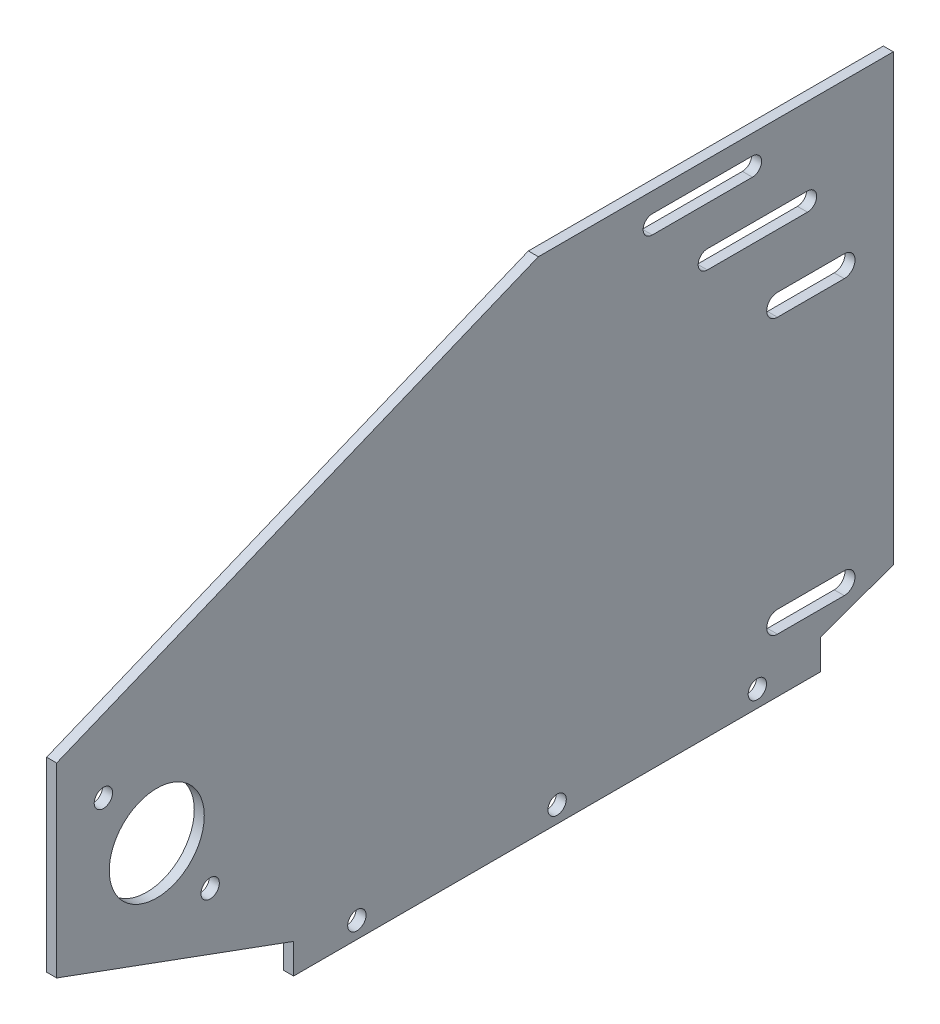
ISO-10303-21;
HEADER;
FILE_DESCRIPTION(('STEP AP214'),'2;1');
FILE_NAME('part.step','',(''),(''),'','','');
FILE_SCHEMA(('AUTOMOTIVE_DESIGN { 1 0 10303 214 1 1 1 1 }'));
ENDSEC;
DATA;
#1=APPLICATION_CONTEXT('core data for automotive mechanical design processes');
#2=APPLICATION_PROTOCOL_DEFINITION('international standard','automotive_design',2000,#1);
#3=PRODUCT_CONTEXT('',#1,'mechanical');
#4=PRODUCT('Part','Part','',(#3));
#5=PRODUCT_RELATED_PRODUCT_CATEGORY('part','',(#4));
#6=PRODUCT_DEFINITION_FORMATION('','',#4);
#7=PRODUCT_DEFINITION_CONTEXT('part definition',#1,'design');
#8=PRODUCT_DEFINITION('design','',#6,#7);
#9=PRODUCT_DEFINITION_SHAPE('','',#8);
#10=(LENGTH_UNIT() NAMED_UNIT(*) SI_UNIT(.MILLI.,.METRE.));
#11=(NAMED_UNIT(*) PLANE_ANGLE_UNIT() SI_UNIT($,.RADIAN.));
#12=(NAMED_UNIT(*) SI_UNIT($,.STERADIAN.) SOLID_ANGLE_UNIT());
#13=UNCERTAINTY_MEASURE_WITH_UNIT(LENGTH_MEASURE(1.E-05),#10,'distance_accuracy_value','');
#14=(GEOMETRIC_REPRESENTATION_CONTEXT(3) GLOBAL_UNCERTAINTY_ASSIGNED_CONTEXT((#13)) GLOBAL_UNIT_ASSIGNED_CONTEXT((#10,
#11,#12)) REPRESENTATION_CONTEXT('',''));
#15=CARTESIAN_POINT('',(0.,0.,0.));
#16=DIRECTION('',(0.,0.,1.));
#17=DIRECTION('',(1.,0.,0.));
#18=AXIS2_PLACEMENT_3D('',#15,#16,#17);
#19=CARTESIAN_POINT('',(3.,0.,0.));
#20=DIRECTION('',(-1.,0.,0.));
#21=DIRECTION('',(0.,0.,1.));
#22=AXIS2_PLACEMENT_3D('',#19,#20,#21);
#23=PLANE('',#22);
#24=DIRECTION('',(0.,0.,-1.));
#25=VECTOR('',#24,1.);
#26=CARTESIAN_POINT('',(3.,144.078111470038,0.));
#27=LINE('',#26,#25);
#28=CARTESIAN_POINT('',(3.,144.078111470038,-178.485850146743));
#29=VERTEX_POINT('',#28);
#30=CARTESIAN_POINT('',(3.,144.078111470038,-208.485850146743));
#31=VERTEX_POINT('',#30);
#32=EDGE_CURVE('E275',#29,#31,#27,.T.);
#33=ORIENTED_EDGE('',*,*,#32,.T.);
#34=CARTESIAN_POINT('',(3.,141.328111470038,-208.485850146743));
#35=DIRECTION('',(-1.,0.,0.));
#36=DIRECTION('',(0.,0.,1.));
#37=AXIS2_PLACEMENT_3D('',#34,#35,#36);
#38=CIRCLE('',#37,2.75000000000003);
#39=CARTESIAN_POINT('',(3.,138.578111470038,-208.485850146743));
#40=VERTEX_POINT('',#39);
#41=EDGE_CURVE('E273',#31,#40,#38,.T.);
#42=ORIENTED_EDGE('',*,*,#41,.T.);
#43=DIRECTION('',(0.,0.,1.));
#44=VECTOR('',#43,1.);
#45=CARTESIAN_POINT('',(3.,138.578111470038,0.));
#46=LINE('',#45,#44);
#47=CARTESIAN_POINT('',(3.,138.578111470038,-178.485850146743));
#48=VERTEX_POINT('',#47);
#49=EDGE_CURVE('E267',#40,#48,#46,.T.);
#50=ORIENTED_EDGE('',*,*,#49,.T.);
#51=CARTESIAN_POINT('',(3.,141.328111470038,-178.485850146743));
#52=DIRECTION('',(-1.,0.,0.));
#53=DIRECTION('',(0.,0.,1.));
#54=AXIS2_PLACEMENT_3D('',#51,#52,#53);
#55=CIRCLE('',#54,2.75000000000003);
#56=EDGE_CURVE('E211',#48,#29,#55,.T.);
#57=ORIENTED_EDGE('',*,*,#56,.T.);
#58=EDGE_LOOP('',(#33,#42,#50,#57));
#59=FACE_BOUND('',#58,.T.);
#60=DIRECTION('',(0.,0.,-1.));
#61=VECTOR('',#60,1.);
#62=CARTESIAN_POINT('',(3.,126.75,0.));
#63=LINE('',#62,#61);
#64=CARTESIAN_POINT('',(3.,126.75,-194.982842505866));
#65=VERTEX_POINT('',#64);
#66=CARTESIAN_POINT('',(3.,126.75,-224.982842505866));
#67=VERTEX_POINT('',#66);
#68=EDGE_CURVE('E265',#65,#67,#63,.T.);
#69=ORIENTED_EDGE('',*,*,#68,.T.);
#70=CARTESIAN_POINT('',(3.,124.,-224.982842505866));
#71=DIRECTION('',(-1.,0.,0.));
#72=DIRECTION('',(0.,0.,1.));
#73=AXIS2_PLACEMENT_3D('',#70,#71,#72);
#74=CIRCLE('',#73,2.75);
#75=CARTESIAN_POINT('',(3.,121.25,-224.982842505866));
#76=VERTEX_POINT('',#75);
#77=EDGE_CURVE('E268',#67,#76,#74,.T.);
#78=ORIENTED_EDGE('',*,*,#77,.T.);
#79=DIRECTION('',(0.,0.,1.));
#80=VECTOR('',#79,1.);
#81=CARTESIAN_POINT('',(3.,121.25,0.));
#82=LINE('',#81,#80);
#83=CARTESIAN_POINT('',(3.,121.25,-194.982842505866));
#84=VERTEX_POINT('',#83);
#85=EDGE_CURVE('E240',#76,#84,#82,.T.);
#86=ORIENTED_EDGE('',*,*,#85,.T.);
#87=CARTESIAN_POINT('',(3.,124.,-194.982842505866));
#88=DIRECTION('',(-1.,0.,0.));
#89=DIRECTION('',(0.,0.,1.));
#90=AXIS2_PLACEMENT_3D('',#87,#88,#89);
#91=CIRCLE('',#90,2.75);
#92=EDGE_CURVE('E257',#84,#65,#91,.T.);
#93=ORIENTED_EDGE('',*,*,#92,.T.);
#94=EDGE_LOOP('',(#69,#78,#86,#93));
#95=FACE_BOUND('',#94,.T.);
#96=CARTESIAN_POINT('',(3.,4.99999999999997,-209.962016184999));
#97=DIRECTION('',(-1.,0.,0.));
#98=DIRECTION('',(0.,0.,1.));
#99=AXIS2_PLACEMENT_3D('',#96,#97,#98);
#100=CIRCLE('',#99,2.75000000000001);
#101=CARTESIAN_POINT('',(3.,4.99999999999997,-207.212016184999));
#102=VERTEX_POINT('',#101);
#103=EDGE_CURVE('E279',#102,#102,#100,.T.);
#104=ORIENTED_EDGE('',*,*,#103,.T.);
#105=EDGE_LOOP('',(#104));
#106=FACE_BOUND('',#105,.T.);
#107=CARTESIAN_POINT('',(3.,4.99999999999997,-149.962016184999));
#108=DIRECTION('',(-1.,0.,0.));
#109=DIRECTION('',(0.,0.,1.));
#110=AXIS2_PLACEMENT_3D('',#107,#108,#109);
#111=CIRCLE('',#110,2.75000000000001);
#112=CARTESIAN_POINT('',(3.,4.99999999999997,-147.212016184999));
#113=VERTEX_POINT('',#112);
#114=EDGE_CURVE('E289',#113,#113,#111,.T.);
#115=ORIENTED_EDGE('',*,*,#114,.T.);
#116=EDGE_LOOP('',(#115));
#117=FACE_BOUND('',#116,.T.);
#118=CARTESIAN_POINT('',(3.,4.99999999999997,-89.9620161849988));
#119=DIRECTION('',(-1.,0.,0.));
#120=DIRECTION('',(0.,0.,1.));
#121=AXIS2_PLACEMENT_3D('',#118,#119,#120);
#122=CIRCLE('',#121,2.75000000000001);
#123=CARTESIAN_POINT('',(3.,4.99999999999997,-87.2120161849988));
#124=VERTEX_POINT('',#123);
#125=EDGE_CURVE('E276',#124,#124,#122,.T.);
#126=ORIENTED_EDGE('',*,*,#125,.T.);
#127=EDGE_LOOP('',(#126));
#128=FACE_BOUND('',#127,.T.);
#129=CARTESIAN_POINT('',(3.,55.,-30.));
#130=DIRECTION('',(1.,0.,0.));
#131=DIRECTION('',(0.,0.,-1.));
#132=AXIS2_PLACEMENT_3D('',#129,#130,#131);
#133=CIRCLE('',#132,14.235);
#134=CARTESIAN_POINT('',(3.,55.,-44.235));
#135=VERTEX_POINT('',#134);
#136=EDGE_CURVE('E426',#135,#135,#133,.T.);
#137=ORIENTED_EDGE('',*,*,#136,.F.);
#138=EDGE_LOOP('',(#137));
#139=FACE_BOUND('',#138,.T.);
#140=DIRECTION('',(0.,0.,-1.));
#141=VECTOR('',#140,1.);
#142=CARTESIAN_POINT('',(3.,98.4784135911546,-216.));
#143=LINE('',#142,#141);
#144=CARTESIAN_POINT('',(3.,98.4784135911546,-216.));
#145=VERTEX_POINT('',#144);
#146=CARTESIAN_POINT('',(3.,98.4784135911546,-236.));
#147=VERTEX_POINT('',#146);
#148=EDGE_CURVE('E392',#145,#147,#143,.T.);
#149=ORIENTED_EDGE('',*,*,#148,.F.);
#150=CARTESIAN_POINT('',(3.,101.708413591155,-216.));
#151=DIRECTION('',(-1.,0.,0.));
#152=DIRECTION('',(0.,0.,1.));
#153=AXIS2_PLACEMENT_3D('',#150,#151,#152);
#154=CIRCLE('',#153,3.22999999999997);
#155=CARTESIAN_POINT('',(3.,104.938413591155,-216.));
#156=VERTEX_POINT('',#155);
#157=EDGE_CURVE('E397',#156,#145,#154,.F.);
#158=ORIENTED_EDGE('',*,*,#157,.F.);
#159=DIRECTION('',(0.,0.,1.));
#160=VECTOR('',#159,1.);
#161=CARTESIAN_POINT('',(3.,104.938413591155,-216.));
#162=LINE('',#161,#160);
#163=CARTESIAN_POINT('',(3.,104.938413591155,-236.));
#164=VERTEX_POINT('',#163);
#165=EDGE_CURVE('E420',#164,#156,#162,.T.);
#166=ORIENTED_EDGE('',*,*,#165,.F.);
#167=CARTESIAN_POINT('',(3.,101.708413591155,-236.));
#168=DIRECTION('',(-1.,0.,0.));
#169=DIRECTION('',(0.,0.,1.));
#170=AXIS2_PLACEMENT_3D('',#167,#168,#169);
#171=CIRCLE('',#170,3.22999999999997);
#172=EDGE_CURVE('E391',#147,#164,#171,.F.);
#173=ORIENTED_EDGE('',*,*,#172,.F.);
#174=EDGE_LOOP('',(#149,#158,#166,#173));
#175=FACE_BOUND('',#174,.T.);
#176=DIRECTION('',(0.,0.,1.));
#177=VECTOR('',#176,1.);
#178=CARTESIAN_POINT('',(3.,22.6816943557675,-236.));
#179=LINE('',#178,#177);
#180=CARTESIAN_POINT('',(3.,22.6816943557675,-236.));
#181=VERTEX_POINT('',#180);
#182=CARTESIAN_POINT('',(3.,22.6816943557675,-216.));
#183=VERTEX_POINT('',#182);
#184=EDGE_CURVE('E383',#181,#183,#179,.T.);
#185=ORIENTED_EDGE('',*,*,#184,.F.);
#186=CARTESIAN_POINT('',(3.,19.4566943557675,-236.));
#187=DIRECTION('',(-1.,0.,0.));
#188=DIRECTION('',(0.,0.,1.));
#189=AXIS2_PLACEMENT_3D('',#186,#187,#188);
#190=CIRCLE('',#189,3.225);
#191=CARTESIAN_POINT('',(3.,16.2316943557675,-236.));
#192=VERTEX_POINT('',#191);
#193=EDGE_CURVE('E382',#192,#181,#190,.F.);
#194=ORIENTED_EDGE('',*,*,#193,.F.);
#195=DIRECTION('',(0.,0.,-1.));
#196=VECTOR('',#195,1.);
#197=CARTESIAN_POINT('',(3.,16.2316943557675,-236.));
#198=LINE('',#197,#196);
#199=CARTESIAN_POINT('',(3.,16.2316943557675,-216.));
#200=VERTEX_POINT('',#199);
#201=EDGE_CURVE('E346',#200,#192,#198,.T.);
#202=ORIENTED_EDGE('',*,*,#201,.F.);
#203=CARTESIAN_POINT('',(3.,19.4566943557675,-216.));
#204=DIRECTION('',(-1.,0.,0.));
#205=DIRECTION('',(0.,0.,1.));
#206=AXIS2_PLACEMENT_3D('',#203,#204,#205);
#207=CIRCLE('',#206,3.225);
#208=EDGE_CURVE('E389',#183,#200,#207,.F.);
#209=ORIENTED_EDGE('',*,*,#208,.F.);
#210=EDGE_LOOP('',(#185,#194,#202,#209));
#211=FACE_BOUND('',#210,.T.);
#212=CARTESIAN_POINT('',(3.,74.7317953801237,-14.0057431846019));
#213=DIRECTION('',(1.,0.,0.));
#214=DIRECTION('',(0.,0.,-1.));
#215=AXIS2_PLACEMENT_3D('',#212,#213,#214);
#216=CIRCLE('',#215,2.75);
#217=CARTESIAN_POINT('',(3.,74.7317953801237,-16.7557431846019));
#218=VERTEX_POINT('',#217);
#219=EDGE_CURVE('E355',#218,#218,#216,.T.);
#220=ORIENTED_EDGE('',*,*,#219,.F.);
#221=EDGE_LOOP('',(#220));
#222=FACE_BOUND('',#221,.T.);
#223=CARTESIAN_POINT('',(3.,35.2682046198761,-45.9942568153991));
#224=DIRECTION('',(1.,0.,0.));
#225=DIRECTION('',(0.,0.,-1.));
#226=AXIS2_PLACEMENT_3D('',#223,#224,#225);
#227=CIRCLE('',#226,2.75);
#228=CARTESIAN_POINT('',(3.,35.2682046198761,-48.7442568153991));
#229=VERTEX_POINT('',#228);
#230=EDGE_CURVE('E350',#229,#229,#227,.T.);
#231=ORIENTED_EDGE('',*,*,#230,.F.);
#232=EDGE_LOOP('',(#231));
#233=FACE_BOUND('',#232,.T.);
#234=DIRECTION('',(0.,0.379469489018988,-0.925204251451358));
#235=VECTOR('',#234,1.);
#236=CARTESIAN_POINT('',(3.,150.745674321996,-146.165756513085));
#237=LINE('',#236,#235);
#238=CARTESIAN_POINT('',(3.,90.796268718762,0.));
#239=VERTEX_POINT('',#238);
#240=CARTESIAN_POINT('',(3.,150.,-144.347689256367));
#241=VERTEX_POINT('',#240);
#242=EDGE_CURVE('E285',#239,#241,#237,.T.);
#243=ORIENTED_EDGE('',*,*,#242,.F.);
#244=DIRECTION('',(0.,-1.,0.));
#245=VECTOR('',#244,1.);
#246=CARTESIAN_POINT('',(3.,0.,0.));
#247=LINE('',#246,#245);
#248=CARTESIAN_POINT('',(3.,35.,0.));
#249=VERTEX_POINT('',#248);
#250=EDGE_CURVE('E434',#239,#249,#247,.T.);
#251=ORIENTED_EDGE('',*,*,#250,.T.);
#252=DIRECTION('',(0.,0.343866011956347,0.939018724957728));
#253=VECTOR('',#252,1.);
#254=CARTESIAN_POINT('',(3.,8.99999999999993,-71.000000000001));
#255=LINE('',#254,#253);
#256=CARTESIAN_POINT('',(3.,8.99999999999993,-71.000000000001));
#257=VERTEX_POINT('',#256);
#258=EDGE_CURVE('E328',#257,#249,#255,.T.);
#259=ORIENTED_EDGE('',*,*,#258,.F.);
#260=DIRECTION('',(0.,1.,-1.07938349616336E-13));
#261=VECTOR('',#260,1.);
#262=CARTESIAN_POINT('',(3.,0.,-71.));
#263=LINE('',#262,#261);
#264=CARTESIAN_POINT('',(3.,0.,-71.));
#265=VERTEX_POINT('',#264);
#266=EDGE_CURVE('E324',#265,#257,#263,.T.);
#267=ORIENTED_EDGE('',*,*,#266,.F.);
#268=DIRECTION('',(0.,0.,-1.));
#269=VECTOR('',#268,1.);
#270=CARTESIAN_POINT('',(3.,0.,0.));
#271=LINE('',#270,#269);
#272=CARTESIAN_POINT('',(3.,0.,-228.924032369997));
#273=VERTEX_POINT('',#272);
#274=EDGE_CURVE('E440',#265,#273,#271,.T.);
#275=ORIENTED_EDGE('',*,*,#274,.T.);
#276=DIRECTION('',(0.,-1.,1.07938349616336E-13));
#277=VECTOR('',#276,1.);
#278=CARTESIAN_POINT('',(3.,0.,-228.924032369998));
#279=LINE('',#278,#277);
#280=CARTESIAN_POINT('',(3.,8.99999999999988,-228.924032369999));
#281=VERTEX_POINT('',#280);
#282=EDGE_CURVE('E306',#281,#273,#279,.T.);
#283=ORIENTED_EDGE('',*,*,#282,.F.);
#284=DIRECTION('',(0.,-0.339870380460165,0.940472287994634));
#285=VECTOR('',#284,1.);
#286=CARTESIAN_POINT('',(3.,8.99999999999988,-228.924032369999));
#287=LINE('',#286,#285);
#288=CARTESIAN_POINT('',(3.,16.8759471545119,-250.717958720685));
#289=VERTEX_POINT('',#288);
#290=EDGE_CURVE('E311',#289,#281,#287,.T.);
#291=ORIENTED_EDGE('',*,*,#290,.F.);
#292=DIRECTION('',(0.,-1.,0.));
#293=VECTOR('',#292,1.);
#294=CARTESIAN_POINT('',(3.,16.8759471545119,-250.717958720685));
#295=LINE('',#294,#293);
#296=CARTESIAN_POINT('',(3.,150.,-250.717958720685));
#297=VERTEX_POINT('',#296);
#298=EDGE_CURVE('E308',#297,#289,#295,.T.);
#299=ORIENTED_EDGE('',*,*,#298,.F.);
#300=DIRECTION('',(0.,0.,1.));
#301=VECTOR('',#300,1.);
#302=CARTESIAN_POINT('',(3.,150.,0.));
#303=LINE('',#302,#301);
#304=EDGE_CURVE('E325',#297,#241,#303,.T.);
#305=ORIENTED_EDGE('',*,*,#304,.T.);
#306=EDGE_LOOP('',(#243,#251,#259,#267,#275,#283,#291,#299,#305));
#307=FACE_BOUND('',#306,.T.);
#308=ADVANCED_FACE('F41',(#59,#95,#106,#117,#128,#139,#175,#211,#222,#233,#307),#23,.F.);
#309=CARTESIAN_POINT('',(3.,150.,0.));
#310=DIRECTION('',(0.,-1.,0.));
#311=DIRECTION('',(0.,0.,-1.));
#312=AXIS2_PLACEMENT_3D('',#309,#310,#311);
#313=PLANE('',#312);
#314=DIRECTION('',(0.,0.,1.));
#315=VECTOR('',#314,1.);
#316=CARTESIAN_POINT('',(0.,150.,0.));
#317=LINE('',#316,#315);
#318=CARTESIAN_POINT('',(0.,150.,-250.717958720685));
#319=VERTEX_POINT('',#318);
#320=CARTESIAN_POINT('',(0.,150.,-144.347689256367));
#321=VERTEX_POINT('',#320);
#322=EDGE_CURVE('E438',#319,#321,#317,.T.);
#323=ORIENTED_EDGE('',*,*,#322,.T.);
#324=DIRECTION('',(1.,0.,0.));
#325=VECTOR('',#324,1.);
#326=CARTESIAN_POINT('',(3.,150.,-144.347689256367));
#327=LINE('',#326,#325);
#328=EDGE_CURVE('E303',#321,#241,#327,.T.);
#329=ORIENTED_EDGE('',*,*,#328,.T.);
#330=ORIENTED_EDGE('',*,*,#304,.F.);
#331=DIRECTION('',(1.,0.,0.));
#332=VECTOR('',#331,1.);
#333=CARTESIAN_POINT('',(-7.,150.,-250.717958720685));
#334=LINE('',#333,#332);
#335=EDGE_CURVE('E316',#319,#297,#334,.T.);
#336=ORIENTED_EDGE('',*,*,#335,.F.);
#337=EDGE_LOOP('',(#323,#329,#330,#336));
#338=FACE_BOUND('',#337,.T.);
#339=ADVANCED_FACE('F468',(#338),#313,.F.);
#340=CARTESIAN_POINT('',(0.,0.,0.));
#341=DIRECTION('',(-1.,0.,0.));
#342=DIRECTION('',(0.,0.,1.));
#343=AXIS2_PLACEMENT_3D('',#340,#341,#342);
#344=PLANE('',#343);
#345=CARTESIAN_POINT('',(0.,141.328111470038,-208.485850146743));
#346=DIRECTION('',(-1.,0.,0.));
#347=DIRECTION('',(0.,0.,1.));
#348=AXIS2_PLACEMENT_3D('',#345,#346,#347);
#349=CIRCLE('',#348,2.75000000000003);
#350=CARTESIAN_POINT('',(0.,144.078111470038,-208.485850146743));
#351=VERTEX_POINT('',#350);
#352=CARTESIAN_POINT('',(0.,138.578111470038,-208.485850146743));
#353=VERTEX_POINT('',#352);
#354=EDGE_CURVE('E224',#351,#353,#349,.T.);
#355=ORIENTED_EDGE('',*,*,#354,.F.);
#356=DIRECTION('',(0.,0.,-1.));
#357=VECTOR('',#356,1.);
#358=CARTESIAN_POINT('',(0.,144.078111470038,-208.485850146743));
#359=LINE('',#358,#357);
#360=CARTESIAN_POINT('',(0.,144.078111470038,-178.485850146743));
#361=VERTEX_POINT('',#360);
#362=EDGE_CURVE('E229',#361,#351,#359,.T.);
#363=ORIENTED_EDGE('',*,*,#362,.F.);
#364=CARTESIAN_POINT('',(0.,141.328111470038,-178.485850146743));
#365=DIRECTION('',(-1.,0.,0.));
#366=DIRECTION('',(0.,0.,1.));
#367=AXIS2_PLACEMENT_3D('',#364,#365,#366);
#368=CIRCLE('',#367,2.75000000000003);
#369=CARTESIAN_POINT('',(0.,138.578111470038,-178.485850146743));
#370=VERTEX_POINT('',#369);
#371=EDGE_CURVE('E208',#370,#361,#368,.T.);
#372=ORIENTED_EDGE('',*,*,#371,.F.);
#373=DIRECTION('',(0.,0.,1.));
#374=VECTOR('',#373,1.);
#375=CARTESIAN_POINT('',(0.,138.578111470038,-208.485850146743));
#376=LINE('',#375,#374);
#377=EDGE_CURVE('E217',#353,#370,#376,.T.);
#378=ORIENTED_EDGE('',*,*,#377,.F.);
#379=EDGE_LOOP('',(#355,#363,#372,#378));
#380=FACE_BOUND('',#379,.T.);
#381=CARTESIAN_POINT('',(0.,124.,-224.982842505866));
#382=DIRECTION('',(-1.,0.,0.));
#383=DIRECTION('',(0.,0.,1.));
#384=AXIS2_PLACEMENT_3D('',#381,#382,#383);
#385=CIRCLE('',#384,2.75);
#386=CARTESIAN_POINT('',(0.,126.75,-224.982842505866));
#387=VERTEX_POINT('',#386);
#388=CARTESIAN_POINT('',(0.,121.25,-224.982842505866));
#389=VERTEX_POINT('',#388);
#390=EDGE_CURVE('E258',#387,#389,#385,.T.);
#391=ORIENTED_EDGE('',*,*,#390,.F.);
#392=DIRECTION('',(0.,0.,-1.));
#393=VECTOR('',#392,1.);
#394=CARTESIAN_POINT('',(0.,126.75,-224.982842505866));
#395=LINE('',#394,#393);
#396=CARTESIAN_POINT('',(0.,126.75,-194.982842505866));
#397=VERTEX_POINT('',#396);
#398=EDGE_CURVE('E243',#397,#387,#395,.T.);
#399=ORIENTED_EDGE('',*,*,#398,.F.);
#400=CARTESIAN_POINT('',(0.,124.,-194.982842505866));
#401=DIRECTION('',(-1.,0.,0.));
#402=DIRECTION('',(0.,0.,1.));
#403=AXIS2_PLACEMENT_3D('',#400,#401,#402);
#404=CIRCLE('',#403,2.75);
#405=CARTESIAN_POINT('',(0.,121.25,-194.982842505866));
#406=VERTEX_POINT('',#405);
#407=EDGE_CURVE('E252',#406,#397,#404,.T.);
#408=ORIENTED_EDGE('',*,*,#407,.F.);
#409=DIRECTION('',(0.,0.,1.));
#410=VECTOR('',#409,1.);
#411=CARTESIAN_POINT('',(0.,121.25,-224.982842505866));
#412=LINE('',#411,#410);
#413=EDGE_CURVE('E251',#389,#406,#412,.T.);
#414=ORIENTED_EDGE('',*,*,#413,.F.);
#415=EDGE_LOOP('',(#391,#399,#408,#414));
#416=FACE_BOUND('',#415,.T.);
#417=CARTESIAN_POINT('',(0.,4.99999999999997,-209.962016184999));
#418=DIRECTION('',(-1.,0.,0.));
#419=DIRECTION('',(0.,0.,1.));
#420=AXIS2_PLACEMENT_3D('',#417,#418,#419);
#421=CIRCLE('',#420,2.75000000000001);
#422=CARTESIAN_POINT('',(0.,4.99999999999997,-207.212016184999));
#423=VERTEX_POINT('',#422);
#424=EDGE_CURVE('E283',#423,#423,#421,.T.);
#425=ORIENTED_EDGE('',*,*,#424,.F.);
#426=EDGE_LOOP('',(#425));
#427=FACE_BOUND('',#426,.T.);
#428=CARTESIAN_POINT('',(0.,4.99999999999997,-149.962016184999));
#429=DIRECTION('',(-1.,0.,0.));
#430=DIRECTION('',(0.,0.,1.));
#431=AXIS2_PLACEMENT_3D('',#428,#429,#430);
#432=CIRCLE('',#431,2.75000000000001);
#433=CARTESIAN_POINT('',(0.,4.99999999999997,-147.212016184999));
#434=VERTEX_POINT('',#433);
#435=EDGE_CURVE('E290',#434,#434,#432,.T.);
#436=ORIENTED_EDGE('',*,*,#435,.F.);
#437=EDGE_LOOP('',(#436));
#438=FACE_BOUND('',#437,.T.);
#439=CARTESIAN_POINT('',(0.,4.99999999999997,-89.9620161849988));
#440=DIRECTION('',(-1.,0.,0.));
#441=DIRECTION('',(0.,0.,1.));
#442=AXIS2_PLACEMENT_3D('',#439,#440,#441);
#443=CIRCLE('',#442,2.75000000000001);
#444=CARTESIAN_POINT('',(0.,4.99999999999997,-87.2120161849988));
#445=VERTEX_POINT('',#444);
#446=EDGE_CURVE('E295',#445,#445,#443,.T.);
#447=ORIENTED_EDGE('',*,*,#446,.F.);
#448=EDGE_LOOP('',(#447));
#449=FACE_BOUND('',#448,.T.);
#450=DIRECTION('',(0.,-0.379469489018988,0.925204251451358));
#451=VECTOR('',#450,1.);
#452=CARTESIAN_POINT('',(0.,77.7218699592669,31.8773700323769));
#453=LINE('',#452,#451);
#454=CARTESIAN_POINT('',(0.,90.796268718762,0.));
#455=VERTEX_POINT('',#454);
#456=EDGE_CURVE('E301',#321,#455,#453,.T.);
#457=ORIENTED_EDGE('',*,*,#456,.F.);
#458=ORIENTED_EDGE('',*,*,#322,.F.);
#459=DIRECTION('',(0.,1.,0.));
#460=VECTOR('',#459,1.);
#461=CARTESIAN_POINT('',(0.,8.3637132286469E-13,-250.717958720685));
#462=LINE('',#461,#460);
#463=CARTESIAN_POINT('',(0.,16.8759471545119,-250.717958720685));
#464=VERTEX_POINT('',#463);
#465=EDGE_CURVE('E453',#464,#319,#462,.T.);
#466=ORIENTED_EDGE('',*,*,#465,.F.);
#467=DIRECTION('',(0.,0.339870380460165,-0.940472287994635));
#468=VECTOR('',#467,1.);
#469=CARTESIAN_POINT('',(0.,-65.2125811093335,-23.5666962603208));
#470=LINE('',#469,#468);
#471=CARTESIAN_POINT('',(0.,8.99999999999988,-228.924032369999));
#472=VERTEX_POINT('',#471);
#473=EDGE_CURVE('E47',#472,#464,#470,.T.);
#474=ORIENTED_EDGE('',*,*,#473,.F.);
#475=DIRECTION('',(0.,1.,-1.07938349616336E-13));
#476=VECTOR('',#475,1.);
#477=CARTESIAN_POINT('',(0.,-2.47096822415342E-11,-228.924032369998));
#478=LINE('',#477,#476);
#479=CARTESIAN_POINT('',(0.,0.,-228.924032369998));
#480=VERTEX_POINT('',#479);
#481=EDGE_CURVE('E320',#480,#472,#478,.T.);
#482=ORIENTED_EDGE('',*,*,#481,.F.);
#483=DIRECTION('',(0.,0.,-1.));
#484=VECTOR('',#483,1.);
#485=CARTESIAN_POINT('',(0.,0.,0.));
#486=LINE('',#485,#484);
#487=CARTESIAN_POINT('',(0.,0.,-71.));
#488=VERTEX_POINT('',#487);
#489=EDGE_CURVE('E443',#488,#480,#486,.T.);
#490=ORIENTED_EDGE('',*,*,#489,.F.);
#491=DIRECTION('',(0.,1.,-1.07938349616336E-13));
#492=VECTOR('',#491,1.);
#493=CARTESIAN_POINT('',(0.,0.,-71.));
#494=LINE('',#493,#492);
#495=CARTESIAN_POINT('',(0.,8.99999999999993,-71.000000000001));
#496=VERTEX_POINT('',#495);
#497=EDGE_CURVE('E322',#488,#496,#494,.T.);
#498=ORIENTED_EDGE('',*,*,#497,.T.);
#499=DIRECTION('',(0.,0.343866011956347,0.939018724957728));
#500=VECTOR('',#499,1.);
#501=CARTESIAN_POINT('',(0.,8.99999999999993,-71.000000000001));
#502=LINE('',#501,#500);
#503=CARTESIAN_POINT('',(0.,35.,0.));
#504=VERTEX_POINT('',#503);
#505=EDGE_CURVE('E330',#496,#504,#502,.T.);
#506=ORIENTED_EDGE('',*,*,#505,.T.);
#507=DIRECTION('',(0.,-1.,0.));
#508=VECTOR('',#507,1.);
#509=CARTESIAN_POINT('',(0.,0.,0.));
#510=LINE('',#509,#508);
#511=EDGE_CURVE('E435',#455,#504,#510,.T.);
#512=ORIENTED_EDGE('',*,*,#511,.F.);
#513=EDGE_LOOP('',(#457,#458,#466,#474,#482,#490,#498,#506,#512));
#514=FACE_BOUND('',#513,.T.);
#515=CARTESIAN_POINT('',(0.,35.2682046198761,-45.9942568153991));
#516=DIRECTION('',(1.,0.,0.));
#517=DIRECTION('',(0.,0.,-1.));
#518=AXIS2_PLACEMENT_3D('',#515,#516,#517);
#519=CIRCLE('',#518,2.75);
#520=CARTESIAN_POINT('',(0.,35.2682046198761,-48.7442568153991));
#521=VERTEX_POINT('',#520);
#522=EDGE_CURVE('E344',#521,#521,#519,.T.);
#523=ORIENTED_EDGE('',*,*,#522,.T.);
#524=EDGE_LOOP('',(#523));
#525=FACE_BOUND('',#524,.T.);
#526=CARTESIAN_POINT('',(0.,74.7317953801237,-14.0057431846019));
#527=DIRECTION('',(1.,0.,0.));
#528=DIRECTION('',(0.,0.,-1.));
#529=AXIS2_PLACEMENT_3D('',#526,#527,#528);
#530=CIRCLE('',#529,2.75);
#531=CARTESIAN_POINT('',(0.,74.7317953801237,-16.7557431846019));
#532=VERTEX_POINT('',#531);
#533=EDGE_CURVE('E339',#532,#532,#530,.T.);
#534=ORIENTED_EDGE('',*,*,#533,.T.);
#535=EDGE_LOOP('',(#534));
#536=FACE_BOUND('',#535,.T.);
#537=CARTESIAN_POINT('',(0.,19.4566943557675,-236.));
#538=DIRECTION('',(-1.,0.,0.));
#539=DIRECTION('',(0.,0.,1.));
#540=AXIS2_PLACEMENT_3D('',#537,#538,#539);
#541=CIRCLE('',#540,3.225);
#542=CARTESIAN_POINT('',(0.,22.6816943557675,-236.));
#543=VERTEX_POINT('',#542);
#544=CARTESIAN_POINT('',(0.,16.2316943557675,-236.));
#545=VERTEX_POINT('',#544);
#546=EDGE_CURVE('E378',#543,#545,#541,.T.);
#547=ORIENTED_EDGE('',*,*,#546,.F.);
#548=DIRECTION('',(0.,0.,-1.));
#549=VECTOR('',#548,1.);
#550=CARTESIAN_POINT('',(0.,22.6816943557675,-236.));
#551=LINE('',#550,#549);
#552=CARTESIAN_POINT('',(0.,22.6816943557675,-216.));
#553=VERTEX_POINT('',#552);
#554=EDGE_CURVE('E362',#553,#543,#551,.T.);
#555=ORIENTED_EDGE('',*,*,#554,.F.);
#556=CARTESIAN_POINT('',(0.,19.4566943557675,-216.));
#557=DIRECTION('',(-1.,0.,0.));
#558=DIRECTION('',(0.,0.,1.));
#559=AXIS2_PLACEMENT_3D('',#556,#557,#558);
#560=CIRCLE('',#559,3.225);
#561=CARTESIAN_POINT('',(0.,16.2316943557675,-216.));
#562=VERTEX_POINT('',#561);
#563=EDGE_CURVE('E373',#562,#553,#560,.T.);
#564=ORIENTED_EDGE('',*,*,#563,.F.);
#565=DIRECTION('',(0.,0.,1.));
#566=VECTOR('',#565,1.);
#567=CARTESIAN_POINT('',(0.,16.2316943557675,-236.));
#568=LINE('',#567,#566);
#569=EDGE_CURVE('E376',#545,#562,#568,.T.);
#570=ORIENTED_EDGE('',*,*,#569,.F.);
#571=EDGE_LOOP('',(#547,#555,#564,#570));
#572=FACE_BOUND('',#571,.T.);
#573=CARTESIAN_POINT('',(0.,101.708413591155,-216.));
#574=DIRECTION('',(-1.,0.,0.));
#575=DIRECTION('',(0.,0.,1.));
#576=AXIS2_PLACEMENT_3D('',#573,#574,#575);
#577=CIRCLE('',#576,3.22999999999997);
#578=CARTESIAN_POINT('',(0.,98.4784135911546,-216.));
#579=VERTEX_POINT('',#578);
#580=CARTESIAN_POINT('',(0.,104.938413591155,-216.));
#581=VERTEX_POINT('',#580);
#582=EDGE_CURVE('E401',#579,#581,#577,.T.);
#583=ORIENTED_EDGE('',*,*,#582,.F.);
#584=DIRECTION('',(0.,0.,1.));
#585=VECTOR('',#584,1.);
#586=CARTESIAN_POINT('',(0.,98.4784135911546,-216.));
#587=LINE('',#586,#585);
#588=CARTESIAN_POINT('',(0.,98.4784135911546,-236.));
#589=VERTEX_POINT('',#588);
#590=EDGE_CURVE('E414',#589,#579,#587,.T.);
#591=ORIENTED_EDGE('',*,*,#590,.F.);
#592=CARTESIAN_POINT('',(0.,101.708413591155,-236.));
#593=DIRECTION('',(-1.,0.,0.));
#594=DIRECTION('',(0.,0.,1.));
#595=AXIS2_PLACEMENT_3D('',#592,#593,#594);
#596=CIRCLE('',#595,3.22999999999997);
#597=CARTESIAN_POINT('',(0.,104.938413591155,-236.));
#598=VERTEX_POINT('',#597);
#599=EDGE_CURVE('E406',#598,#589,#596,.T.);
#600=ORIENTED_EDGE('',*,*,#599,.F.);
#601=DIRECTION('',(0.,0.,-1.));
#602=VECTOR('',#601,1.);
#603=CARTESIAN_POINT('',(0.,104.938413591155,-216.));
#604=LINE('',#603,#602);
#605=EDGE_CURVE('E403',#581,#598,#604,.T.);
#606=ORIENTED_EDGE('',*,*,#605,.F.);
#607=EDGE_LOOP('',(#583,#591,#600,#606));
#608=FACE_BOUND('',#607,.T.);
#609=CARTESIAN_POINT('',(0.,55.,-30.));
#610=DIRECTION('',(1.,0.,0.));
#611=DIRECTION('',(0.,0.,-1.));
#612=AXIS2_PLACEMENT_3D('',#609,#610,#611);
#613=CIRCLE('',#612,14.235);
#614=CARTESIAN_POINT('',(0.,55.,-44.235));
#615=VERTEX_POINT('',#614);
#616=EDGE_CURVE('E430',#615,#615,#613,.T.);
#617=ORIENTED_EDGE('',*,*,#616,.T.);
#618=EDGE_LOOP('',(#617));
#619=FACE_BOUND('',#618,.T.);
#620=ADVANCED_FACE('F227',(#380,#416,#427,#438,#449,#514,#525,#536,#572,#608,#619),#344,.T.);
#621=CARTESIAN_POINT('',(3.,0.,0.));
#622=DIRECTION('',(0.,1.,0.));
#623=DIRECTION('',(0.,0.,1.));
#624=AXIS2_PLACEMENT_3D('',#621,#622,#623);
#625=PLANE('',#624);
#626=ORIENTED_EDGE('',*,*,#489,.T.);
#627=DIRECTION('',(1.,0.,0.));
#628=VECTOR('',#627,1.);
#629=CARTESIAN_POINT('',(3.,0.,-228.924032369997));
#630=LINE('',#629,#628);
#631=EDGE_CURVE('E323',#480,#273,#630,.T.);
#632=ORIENTED_EDGE('',*,*,#631,.T.);
#633=ORIENTED_EDGE('',*,*,#274,.F.);
#634=DIRECTION('',(1.,0.,0.));
#635=VECTOR('',#634,1.);
#636=CARTESIAN_POINT('',(0.,0.,-71.));
#637=LINE('',#636,#635);
#638=EDGE_CURVE('E340',#488,#265,#637,.T.);
#639=ORIENTED_EDGE('',*,*,#638,.F.);
#640=EDGE_LOOP('',(#626,#632,#633,#639));
#641=FACE_BOUND('',#640,.T.);
#642=ADVANCED_FACE('F477',(#641),#625,.F.);
#643=CARTESIAN_POINT('',(3.,0.,0.));
#644=DIRECTION('',(0.,0.,-1.));
#645=DIRECTION('',(-1.,0.,0.));
#646=AXIS2_PLACEMENT_3D('',#643,#644,#645);
#647=PLANE('',#646);
#648=ORIENTED_EDGE('',*,*,#250,.F.);
#649=DIRECTION('',(-1.,0.,0.));
#650=VECTOR('',#649,1.);
#651=CARTESIAN_POINT('',(3.,90.796268718762,0.));
#652=LINE('',#651,#650);
#653=EDGE_CURVE('E11',#239,#455,#652,.T.);
#654=ORIENTED_EDGE('',*,*,#653,.T.);
#655=ORIENTED_EDGE('',*,*,#511,.T.);
#656=DIRECTION('',(1.,0.,0.));
#657=VECTOR('',#656,1.);
#658=CARTESIAN_POINT('',(0.,35.,0.));
#659=LINE('',#658,#657);
#660=EDGE_CURVE('E338',#504,#249,#659,.T.);
#661=ORIENTED_EDGE('',*,*,#660,.T.);
#662=EDGE_LOOP('',(#648,#654,#655,#661));
#663=FACE_BOUND('',#662,.T.);
#664=ADVANCED_FACE('F43',(#663),#647,.F.);
#665=CARTESIAN_POINT('',(3.,55.,-30.));
#666=DIRECTION('',(-1.,0.,0.));
#667=DIRECTION('',(0.,0.,1.));
#668=AXIS2_PLACEMENT_3D('',#665,#666,#667);
#669=CYLINDRICAL_SURFACE('',#668,14.235);
#670=ORIENTED_EDGE('',*,*,#136,.T.);
#671=EDGE_LOOP('',(#670));
#672=FACE_BOUND('',#671,.T.);
#673=ORIENTED_EDGE('',*,*,#616,.F.);
#674=EDGE_LOOP('',(#673));
#675=FACE_BOUND('',#674,.T.);
#676=ADVANCED_FACE('F519',(#672,#675),#669,.F.);
#677=CARTESIAN_POINT('',(3.001,101.708413591155,-216.));
#678=DIRECTION('',(-1.,0.,0.));
#679=DIRECTION('',(0.,0.,1.));
#680=AXIS2_PLACEMENT_3D('',#677,#678,#679);
#681=CYLINDRICAL_SURFACE('',#680,3.22999999999997);
#682=ORIENTED_EDGE('',*,*,#157,.T.);
#683=DIRECTION('',(-1.,0.,0.));
#684=VECTOR('',#683,1.);
#685=CARTESIAN_POINT('',(3.001,98.4784135911546,-216.));
#686=LINE('',#685,#684);
#687=EDGE_CURVE('E412',#145,#579,#686,.T.);
#688=ORIENTED_EDGE('',*,*,#687,.T.);
#689=ORIENTED_EDGE('',*,*,#582,.T.);
#690=DIRECTION('',(-1.,0.,0.));
#691=VECTOR('',#690,1.);
#692=CARTESIAN_POINT('',(3.001,104.938413591155,-216.));
#693=LINE('',#692,#691);
#694=EDGE_CURVE('E413',#156,#581,#693,.T.);
#695=ORIENTED_EDGE('',*,*,#694,.F.);
#696=EDGE_LOOP('',(#682,#688,#689,#695));
#697=FACE_BOUND('',#696,.T.);
#698=ADVANCED_FACE('F526',(#697),#681,.F.);
#699=CARTESIAN_POINT('',(3.001,98.4784135911546,-216.));
#700=DIRECTION('',(0.,-1.,0.));
#701=DIRECTION('',(0.,0.,-1.));
#702=AXIS2_PLACEMENT_3D('',#699,#700,#701);
#703=PLANE('',#702);
#704=ORIENTED_EDGE('',*,*,#148,.T.);
#705=DIRECTION('',(-1.,0.,0.));
#706=VECTOR('',#705,1.);
#707=CARTESIAN_POINT('',(3.001,98.4784135911546,-236.));
#708=LINE('',#707,#706);
#709=EDGE_CURVE('E416',#147,#589,#708,.T.);
#710=ORIENTED_EDGE('',*,*,#709,.T.);
#711=ORIENTED_EDGE('',*,*,#590,.T.);
#712=ORIENTED_EDGE('',*,*,#687,.F.);
#713=EDGE_LOOP('',(#704,#710,#711,#712));
#714=FACE_BOUND('',#713,.T.);
#715=ADVANCED_FACE('F531',(#714),#703,.F.);
#716=CARTESIAN_POINT('',(3.001,101.708413591155,-236.));
#717=DIRECTION('',(-1.,0.,0.));
#718=DIRECTION('',(0.,0.,1.));
#719=AXIS2_PLACEMENT_3D('',#716,#717,#718);
#720=CYLINDRICAL_SURFACE('',#719,3.22999999999997);
#721=ORIENTED_EDGE('',*,*,#172,.T.);
#722=DIRECTION('',(-1.,0.,0.));
#723=VECTOR('',#722,1.);
#724=CARTESIAN_POINT('',(3.001,104.938413591155,-236.));
#725=LINE('',#724,#723);
#726=EDGE_CURVE('E419',#164,#598,#725,.T.);
#727=ORIENTED_EDGE('',*,*,#726,.T.);
#728=ORIENTED_EDGE('',*,*,#599,.T.);
#729=ORIENTED_EDGE('',*,*,#709,.F.);
#730=EDGE_LOOP('',(#721,#727,#728,#729));
#731=FACE_BOUND('',#730,.T.);
#732=ADVANCED_FACE('F586',(#731),#720,.F.);
#733=CARTESIAN_POINT('',(3.001,104.938413591155,-216.));
#734=DIRECTION('',(0.,1.,0.));
#735=DIRECTION('',(0.,0.,1.));
#736=AXIS2_PLACEMENT_3D('',#733,#734,#735);
#737=PLANE('',#736);
#738=ORIENTED_EDGE('',*,*,#165,.T.);
#739=ORIENTED_EDGE('',*,*,#694,.T.);
#740=ORIENTED_EDGE('',*,*,#605,.T.);
#741=ORIENTED_EDGE('',*,*,#726,.F.);
#742=EDGE_LOOP('',(#738,#739,#740,#741));
#743=FACE_BOUND('',#742,.T.);
#744=ADVANCED_FACE('F572',(#743),#737,.F.);
#745=CARTESIAN_POINT('',(3.001,19.4566943557675,-236.));
#746=DIRECTION('',(-1.,0.,0.));
#747=DIRECTION('',(0.,0.,1.));
#748=AXIS2_PLACEMENT_3D('',#745,#746,#747);
#749=CYLINDRICAL_SURFACE('',#748,3.225);
#750=ORIENTED_EDGE('',*,*,#193,.T.);
#751=DIRECTION('',(-1.,0.,0.));
#752=VECTOR('',#751,1.);
#753=CARTESIAN_POINT('',(3.001,22.6816943557675,-236.));
#754=LINE('',#753,#752);
#755=EDGE_CURVE('E363',#181,#543,#754,.T.);
#756=ORIENTED_EDGE('',*,*,#755,.T.);
#757=ORIENTED_EDGE('',*,*,#546,.T.);
#758=DIRECTION('',(-1.,0.,0.));
#759=VECTOR('',#758,1.);
#760=CARTESIAN_POINT('',(3.001,16.2316943557675,-236.));
#761=LINE('',#760,#759);
#762=EDGE_CURVE('E365',#192,#545,#761,.T.);
#763=ORIENTED_EDGE('',*,*,#762,.F.);
#764=EDGE_LOOP('',(#750,#756,#757,#763));
#765=FACE_BOUND('',#764,.T.);
#766=ADVANCED_FACE('F567',(#765),#749,.F.);
#767=CARTESIAN_POINT('',(3.001,22.6816943557675,-236.));
#768=DIRECTION('',(0.,1.,0.));
#769=DIRECTION('',(0.,0.,1.));
#770=AXIS2_PLACEMENT_3D('',#767,#768,#769);
#771=PLANE('',#770);
#772=ORIENTED_EDGE('',*,*,#184,.T.);
#773=DIRECTION('',(-1.,0.,0.));
#774=VECTOR('',#773,1.);
#775=CARTESIAN_POINT('',(3.001,22.6816943557675,-216.));
#776=LINE('',#775,#774);
#777=EDGE_CURVE('E368',#183,#553,#776,.T.);
#778=ORIENTED_EDGE('',*,*,#777,.T.);
#779=ORIENTED_EDGE('',*,*,#554,.T.);
#780=ORIENTED_EDGE('',*,*,#755,.F.);
#781=EDGE_LOOP('',(#772,#778,#779,#780));
#782=FACE_BOUND('',#781,.T.);
#783=ADVANCED_FACE('F575',(#782),#771,.F.);
#784=CARTESIAN_POINT('',(3.001,19.4566943557675,-216.));
#785=DIRECTION('',(-1.,0.,0.));
#786=DIRECTION('',(0.,0.,1.));
#787=AXIS2_PLACEMENT_3D('',#784,#785,#786);
#788=CYLINDRICAL_SURFACE('',#787,3.225);
#789=ORIENTED_EDGE('',*,*,#208,.T.);
#790=DIRECTION('',(-1.,0.,0.));
#791=VECTOR('',#790,1.);
#792=CARTESIAN_POINT('',(3.001,16.2316943557675,-216.));
#793=LINE('',#792,#791);
#794=EDGE_CURVE('E366',#200,#562,#793,.T.);
#795=ORIENTED_EDGE('',*,*,#794,.T.);
#796=ORIENTED_EDGE('',*,*,#563,.T.);
#797=ORIENTED_EDGE('',*,*,#777,.F.);
#798=EDGE_LOOP('',(#789,#795,#796,#797));
#799=FACE_BOUND('',#798,.T.);
#800=ADVANCED_FACE('F580',(#799),#788,.F.);
#801=CARTESIAN_POINT('',(3.001,16.2316943557675,-236.));
#802=DIRECTION('',(0.,-1.,0.));
#803=DIRECTION('',(0.,0.,-1.));
#804=AXIS2_PLACEMENT_3D('',#801,#802,#803);
#805=PLANE('',#804);
#806=ORIENTED_EDGE('',*,*,#201,.T.);
#807=ORIENTED_EDGE('',*,*,#762,.T.);
#808=ORIENTED_EDGE('',*,*,#569,.T.);
#809=ORIENTED_EDGE('',*,*,#794,.F.);
#810=EDGE_LOOP('',(#806,#807,#808,#809));
#811=FACE_BOUND('',#810,.T.);
#812=ADVANCED_FACE('F563',(#811),#805,.F.);
#813=CARTESIAN_POINT('',(0.,74.7317953801237,-14.0057431846019));
#814=DIRECTION('',(1.,0.,0.));
#815=DIRECTION('',(0.,0.,-1.));
#816=AXIS2_PLACEMENT_3D('',#813,#814,#815);
#817=CYLINDRICAL_SURFACE('',#816,2.75);
#818=ORIENTED_EDGE('',*,*,#533,.F.);
#819=EDGE_LOOP('',(#818));
#820=FACE_BOUND('',#819,.T.);
#821=ORIENTED_EDGE('',*,*,#219,.T.);
#822=EDGE_LOOP('',(#821));
#823=FACE_BOUND('',#822,.T.);
#824=ADVANCED_FACE('F554',(#820,#823),#817,.F.);
#825=CARTESIAN_POINT('',(0.,35.2682046198761,-45.9942568153991));
#826=DIRECTION('',(1.,0.,0.));
#827=DIRECTION('',(0.,0.,-1.));
#828=AXIS2_PLACEMENT_3D('',#825,#826,#827);
#829=CYLINDRICAL_SURFACE('',#828,2.75);
#830=ORIENTED_EDGE('',*,*,#522,.F.);
#831=EDGE_LOOP('',(#830));
#832=FACE_BOUND('',#831,.T.);
#833=ORIENTED_EDGE('',*,*,#230,.T.);
#834=EDGE_LOOP('',(#833));
#835=FACE_BOUND('',#834,.T.);
#836=ADVANCED_FACE('F551',(#832,#835),#829,.F.);
#837=CARTESIAN_POINT('',(0.,0.,-71.));
#838=DIRECTION('',(0.,-1.07938349616336E-13,-1.));
#839=DIRECTION('',(0.,1.,-1.07938349616336E-13));
#840=AXIS2_PLACEMENT_3D('',#837,#838,#839);
#841=PLANE('',#840);
#842=ORIENTED_EDGE('',*,*,#266,.T.);
#843=DIRECTION('',(1.,0.,0.));
#844=VECTOR('',#843,1.);
#845=CARTESIAN_POINT('',(0.,8.99999999999993,-71.000000000001));
#846=LINE('',#845,#844);
#847=EDGE_CURVE('E335',#496,#257,#846,.T.);
#848=ORIENTED_EDGE('',*,*,#847,.F.);
#849=ORIENTED_EDGE('',*,*,#497,.F.);
#850=ORIENTED_EDGE('',*,*,#638,.T.);
#851=EDGE_LOOP('',(#842,#848,#849,#850));
#852=FACE_BOUND('',#851,.T.);
#853=ADVANCED_FACE('F484',(#852),#841,.F.);
#854=CARTESIAN_POINT('',(0.,8.99999999999993,-71.000000000001));
#855=DIRECTION('',(0.,0.939018724957728,-0.343866011956347));
#856=DIRECTION('',(0.,0.343866011956347,0.939018724957728));
#857=AXIS2_PLACEMENT_3D('',#854,#855,#856);
#858=PLANE('',#857);
#859=ORIENTED_EDGE('',*,*,#258,.T.);
#860=ORIENTED_EDGE('',*,*,#660,.F.);
#861=ORIENTED_EDGE('',*,*,#505,.F.);
#862=ORIENTED_EDGE('',*,*,#847,.T.);
#863=EDGE_LOOP('',(#859,#860,#861,#862));
#864=FACE_BOUND('',#863,.T.);
#865=ADVANCED_FACE('F490',(#864),#858,.F.);
#866=CARTESIAN_POINT('',(-7.,0.,-228.924032369998));
#867=DIRECTION('',(0.,1.07938349616336E-13,1.));
#868=DIRECTION('',(0.,-1.,1.07938349616336E-13));
#869=AXIS2_PLACEMENT_3D('',#866,#867,#868);
#870=PLANE('',#869);
#871=ORIENTED_EDGE('',*,*,#481,.T.);
#872=DIRECTION('',(1.,0.,0.));
#873=VECTOR('',#872,1.);
#874=CARTESIAN_POINT('',(-7.,8.99999999999988,-228.924032369999));
#875=LINE('',#874,#873);
#876=EDGE_CURVE('E314',#472,#281,#875,.T.);
#877=ORIENTED_EDGE('',*,*,#876,.T.);
#878=ORIENTED_EDGE('',*,*,#282,.T.);
#879=ORIENTED_EDGE('',*,*,#631,.F.);
#880=EDGE_LOOP('',(#871,#877,#878,#879));
#881=FACE_BOUND('',#880,.T.);
#882=ADVANCED_FACE('F480',(#881),#870,.F.);
#883=CARTESIAN_POINT('',(-7.,8.99999999999988,-228.924032369999));
#884=DIRECTION('',(0.,0.940472287994635,0.339870380460165));
#885=DIRECTION('',(0.,-0.339870380460165,0.940472287994635));
#886=AXIS2_PLACEMENT_3D('',#883,#884,#885);
#887=PLANE('',#886);
#888=ORIENTED_EDGE('',*,*,#473,.T.);
#889=DIRECTION('',(1.,0.,0.));
#890=VECTOR('',#889,1.);
#891=CARTESIAN_POINT('',(-7.,16.8759471545119,-250.717958720685));
#892=LINE('',#891,#890);
#893=EDGE_CURVE('E313',#464,#289,#892,.T.);
#894=ORIENTED_EDGE('',*,*,#893,.T.);
#895=ORIENTED_EDGE('',*,*,#290,.T.);
#896=ORIENTED_EDGE('',*,*,#876,.F.);
#897=EDGE_LOOP('',(#888,#894,#895,#896));
#898=FACE_BOUND('',#897,.T.);
#899=ADVANCED_FACE('F459',(#898),#887,.F.);
#900=CARTESIAN_POINT('',(-7.,16.8759471545119,-250.717958720685));
#901=DIRECTION('',(0.,0.,1.));
#902=DIRECTION('',(0.,-1.,0.));
#903=AXIS2_PLACEMENT_3D('',#900,#901,#902);
#904=PLANE('',#903);
#905=ORIENTED_EDGE('',*,*,#465,.T.);
#906=ORIENTED_EDGE('',*,*,#335,.T.);
#907=ORIENTED_EDGE('',*,*,#298,.T.);
#908=ORIENTED_EDGE('',*,*,#893,.F.);
#909=EDGE_LOOP('',(#905,#906,#907,#908));
#910=FACE_BOUND('',#909,.T.);
#911=ADVANCED_FACE('F463',(#910),#904,.F.);
#912=CARTESIAN_POINT('',(-7.,150.745674321996,-146.165756513085));
#913=DIRECTION('',(0.,-0.925204251451358,-0.379469489018988));
#914=DIRECTION('',(0.,0.379469489018988,-0.925204251451358));
#915=AXIS2_PLACEMENT_3D('',#912,#913,#914);
#916=PLANE('',#915);
#917=ORIENTED_EDGE('',*,*,#456,.T.);
#918=ORIENTED_EDGE('',*,*,#653,.F.);
#919=ORIENTED_EDGE('',*,*,#242,.T.);
#920=ORIENTED_EDGE('',*,*,#328,.F.);
#921=EDGE_LOOP('',(#917,#918,#919,#920));
#922=FACE_BOUND('',#921,.T.);
#923=ADVANCED_FACE('F491',(#922),#916,.F.);
#924=CARTESIAN_POINT('',(3.,4.99999999999997,-89.9620161849988));
#925=DIRECTION('',(-1.,0.,0.));
#926=DIRECTION('',(0.,0.,1.));
#927=AXIS2_PLACEMENT_3D('',#924,#925,#926);
#928=CYLINDRICAL_SURFACE('',#927,2.75000000000001);
#929=ORIENTED_EDGE('',*,*,#125,.F.);
#930=EDGE_LOOP('',(#929));
#931=FACE_BOUND('',#930,.T.);
#932=ORIENTED_EDGE('',*,*,#446,.T.);
#933=EDGE_LOOP('',(#932));
#934=FACE_BOUND('',#933,.T.);
#935=ADVANCED_FACE('F492',(#931,#934),#928,.F.);
#936=CARTESIAN_POINT('',(3.,4.99999999999997,-149.962016184999));
#937=DIRECTION('',(-1.,0.,0.));
#938=DIRECTION('',(0.,0.,1.));
#939=AXIS2_PLACEMENT_3D('',#936,#937,#938);
#940=CYLINDRICAL_SURFACE('',#939,2.75000000000001);
#941=ORIENTED_EDGE('',*,*,#114,.F.);
#942=EDGE_LOOP('',(#941));
#943=FACE_BOUND('',#942,.T.);
#944=ORIENTED_EDGE('',*,*,#435,.T.);
#945=EDGE_LOOP('',(#944));
#946=FACE_BOUND('',#945,.T.);
#947=ADVANCED_FACE('F501',(#943,#946),#940,.F.);
#948=CARTESIAN_POINT('',(3.,4.99999999999997,-209.962016184999));
#949=DIRECTION('',(-1.,0.,0.));
#950=DIRECTION('',(0.,0.,1.));
#951=AXIS2_PLACEMENT_3D('',#948,#949,#950);
#952=CYLINDRICAL_SURFACE('',#951,2.75000000000001);
#953=ORIENTED_EDGE('',*,*,#103,.F.);
#954=EDGE_LOOP('',(#953));
#955=FACE_BOUND('',#954,.T.);
#956=ORIENTED_EDGE('',*,*,#424,.T.);
#957=EDGE_LOOP('',(#956));
#958=FACE_BOUND('',#957,.T.);
#959=ADVANCED_FACE('F709',(#955,#958),#952,.F.);
#960=CARTESIAN_POINT('',(10.,124.,-224.982842505866));
#961=DIRECTION('',(-1.,0.,0.));
#962=DIRECTION('',(0.,0.,1.));
#963=AXIS2_PLACEMENT_3D('',#960,#961,#962);
#964=CYLINDRICAL_SURFACE('',#963,2.75);
#965=DIRECTION('',(-1.,0.,0.));
#966=VECTOR('',#965,1.);
#967=CARTESIAN_POINT('',(10.,126.75,-224.982842505866));
#968=LINE('',#967,#966);
#969=EDGE_CURVE('E250',#67,#387,#968,.T.);
#970=ORIENTED_EDGE('',*,*,#969,.T.);
#971=ORIENTED_EDGE('',*,*,#390,.T.);
#972=DIRECTION('',(-1.,0.,0.));
#973=VECTOR('',#972,1.);
#974=CARTESIAN_POINT('',(10.,121.25,-224.982842505866));
#975=LINE('',#974,#973);
#976=EDGE_CURVE('E239',#76,#389,#975,.T.);
#977=ORIENTED_EDGE('',*,*,#976,.F.);
#978=ORIENTED_EDGE('',*,*,#77,.F.);
#979=EDGE_LOOP('',(#970,#971,#977,#978));
#980=FACE_BOUND('',#979,.T.);
#981=ADVANCED_FACE('F716',(#980),#964,.F.);
#982=CARTESIAN_POINT('',(10.,126.75,-224.982842505866));
#983=DIRECTION('',(0.,1.,0.));
#984=DIRECTION('',(0.,0.,1.));
#985=AXIS2_PLACEMENT_3D('',#982,#983,#984);
#986=PLANE('',#985);
#987=DIRECTION('',(-1.,0.,0.));
#988=VECTOR('',#987,1.);
#989=CARTESIAN_POINT('',(10.,126.75,-194.982842505866));
#990=LINE('',#989,#988);
#991=EDGE_CURVE('E244',#65,#397,#990,.T.);
#992=ORIENTED_EDGE('',*,*,#991,.T.);
#993=ORIENTED_EDGE('',*,*,#398,.T.);
#994=ORIENTED_EDGE('',*,*,#969,.F.);
#995=ORIENTED_EDGE('',*,*,#68,.F.);
#996=EDGE_LOOP('',(#992,#993,#994,#995));
#997=FACE_BOUND('',#996,.T.);
#998=ADVANCED_FACE('F730',(#997),#986,.F.);
#999=CARTESIAN_POINT('',(10.,124.,-194.982842505866));
#1000=DIRECTION('',(-1.,0.,0.));
#1001=DIRECTION('',(0.,0.,1.));
#1002=AXIS2_PLACEMENT_3D('',#999,#1000,#1001);
#1003=CYLINDRICAL_SURFACE('',#1002,2.75);
#1004=DIRECTION('',(-1.,0.,0.));
#1005=VECTOR('',#1004,1.);
#1006=CARTESIAN_POINT('',(10.,121.25,-194.982842505866));
#1007=LINE('',#1006,#1005);
#1008=EDGE_CURVE('E64',#84,#406,#1007,.T.);
#1009=ORIENTED_EDGE('',*,*,#1008,.T.);
#1010=ORIENTED_EDGE('',*,*,#407,.T.);
#1011=ORIENTED_EDGE('',*,*,#991,.F.);
#1012=ORIENTED_EDGE('',*,*,#92,.F.);
#1013=EDGE_LOOP('',(#1009,#1010,#1011,#1012));
#1014=FACE_BOUND('',#1013,.T.);
#1015=ADVANCED_FACE('F736',(#1014),#1003,.F.);
#1016=CARTESIAN_POINT('',(10.,121.25,-224.982842505866));
#1017=DIRECTION('',(0.,-1.,0.));
#1018=DIRECTION('',(0.,0.,-1.));
#1019=AXIS2_PLACEMENT_3D('',#1016,#1017,#1018);
#1020=PLANE('',#1019);
#1021=ORIENTED_EDGE('',*,*,#976,.T.);
#1022=ORIENTED_EDGE('',*,*,#413,.T.);
#1023=ORIENTED_EDGE('',*,*,#1008,.F.);
#1024=ORIENTED_EDGE('',*,*,#85,.F.);
#1025=EDGE_LOOP('',(#1021,#1022,#1023,#1024));
#1026=FACE_BOUND('',#1025,.T.);
#1027=ADVANCED_FACE('F747',(#1026),#1020,.F.);
#1028=CARTESIAN_POINT('',(10.,141.328111470038,-208.485850146743));
#1029=DIRECTION('',(-1.,0.,0.));
#1030=DIRECTION('',(0.,0.,1.));
#1031=AXIS2_PLACEMENT_3D('',#1028,#1029,#1030);
#1032=CYLINDRICAL_SURFACE('',#1031,2.75000000000003);
#1033=DIRECTION('',(-1.,0.,0.));
#1034=VECTOR('',#1033,1.);
#1035=CARTESIAN_POINT('',(10.,144.078111470038,-208.485850146743));
#1036=LINE('',#1035,#1034);
#1037=EDGE_CURVE('E232',#31,#351,#1036,.T.);
#1038=ORIENTED_EDGE('',*,*,#1037,.T.);
#1039=ORIENTED_EDGE('',*,*,#354,.T.);
#1040=DIRECTION('',(-1.,0.,0.));
#1041=VECTOR('',#1040,1.);
#1042=CARTESIAN_POINT('',(10.,138.578111470038,-208.485850146743));
#1043=LINE('',#1042,#1041);
#1044=EDGE_CURVE('E219',#40,#353,#1043,.T.);
#1045=ORIENTED_EDGE('',*,*,#1044,.F.);
#1046=ORIENTED_EDGE('',*,*,#41,.F.);
#1047=EDGE_LOOP('',(#1038,#1039,#1045,#1046));
#1048=FACE_BOUND('',#1047,.T.);
#1049=ADVANCED_FACE('F760',(#1048),#1032,.F.);
#1050=CARTESIAN_POINT('',(10.,144.078111470038,-208.485850146743));
#1051=DIRECTION('',(0.,1.,0.));
#1052=DIRECTION('',(0.,0.,1.));
#1053=AXIS2_PLACEMENT_3D('',#1050,#1051,#1052);
#1054=PLANE('',#1053);
#1055=DIRECTION('',(-1.,0.,0.));
#1056=VECTOR('',#1055,1.);
#1057=CARTESIAN_POINT('',(10.,144.078111470038,-178.485850146743));
#1058=LINE('',#1057,#1056);
#1059=EDGE_CURVE('E212',#29,#361,#1058,.T.);
#1060=ORIENTED_EDGE('',*,*,#1059,.T.);
#1061=ORIENTED_EDGE('',*,*,#362,.T.);
#1062=ORIENTED_EDGE('',*,*,#1037,.F.);
#1063=ORIENTED_EDGE('',*,*,#32,.F.);
#1064=EDGE_LOOP('',(#1060,#1061,#1062,#1063));
#1065=FACE_BOUND('',#1064,.T.);
#1066=ADVANCED_FACE('F766',(#1065),#1054,.F.);
#1067=CARTESIAN_POINT('',(10.,141.328111470038,-178.485850146743));
#1068=DIRECTION('',(-1.,0.,0.));
#1069=DIRECTION('',(0.,0.,1.));
#1070=AXIS2_PLACEMENT_3D('',#1067,#1068,#1069);
#1071=CYLINDRICAL_SURFACE('',#1070,2.75000000000003);
#1072=DIRECTION('',(-1.,0.,0.));
#1073=VECTOR('',#1072,1.);
#1074=CARTESIAN_POINT('',(10.,138.578111470038,-178.485850146743));
#1075=LINE('',#1074,#1073);
#1076=EDGE_CURVE('E57',#48,#370,#1075,.T.);
#1077=ORIENTED_EDGE('',*,*,#1076,.T.);
#1078=ORIENTED_EDGE('',*,*,#371,.T.);
#1079=ORIENTED_EDGE('',*,*,#1059,.F.);
#1080=ORIENTED_EDGE('',*,*,#56,.F.);
#1081=EDGE_LOOP('',(#1077,#1078,#1079,#1080));
#1082=FACE_BOUND('',#1081,.T.);
#1083=ADVANCED_FACE('F210',(#1082),#1071,.F.);
#1084=CARTESIAN_POINT('',(10.,138.578111470038,-208.485850146743));
#1085=DIRECTION('',(0.,-1.,0.));
#1086=DIRECTION('',(0.,0.,-1.));
#1087=AXIS2_PLACEMENT_3D('',#1084,#1085,#1086);
#1088=PLANE('',#1087);
#1089=ORIENTED_EDGE('',*,*,#1044,.T.);
#1090=ORIENTED_EDGE('',*,*,#377,.T.);
#1091=ORIENTED_EDGE('',*,*,#1076,.F.);
#1092=ORIENTED_EDGE('',*,*,#49,.F.);
#1093=EDGE_LOOP('',(#1089,#1090,#1091,#1092));
#1094=FACE_BOUND('',#1093,.T.);
#1095=ADVANCED_FACE('F223',(#1094),#1088,.F.);
#1096=CLOSED_SHELL('',(#308,#339,#620,#642,#664,#676,#698,#715,#732,#744,#766,#783,#800,#812,
#824,#836,#853,#865,#882,#899,#911,#923,#935,#947,#959,#981,#998,#1015,#1027,#1049,#1066,#1083,#1095));
#1097=MANIFOLD_SOLID_BREP('B2',#1096);
#1098=ADVANCED_BREP_SHAPE_REPRESENTATION('',(#18,#1097),#14);
#1099=SHAPE_DEFINITION_REPRESENTATION(#9,#1098);
ENDSEC;
END-ISO-10303-21;
